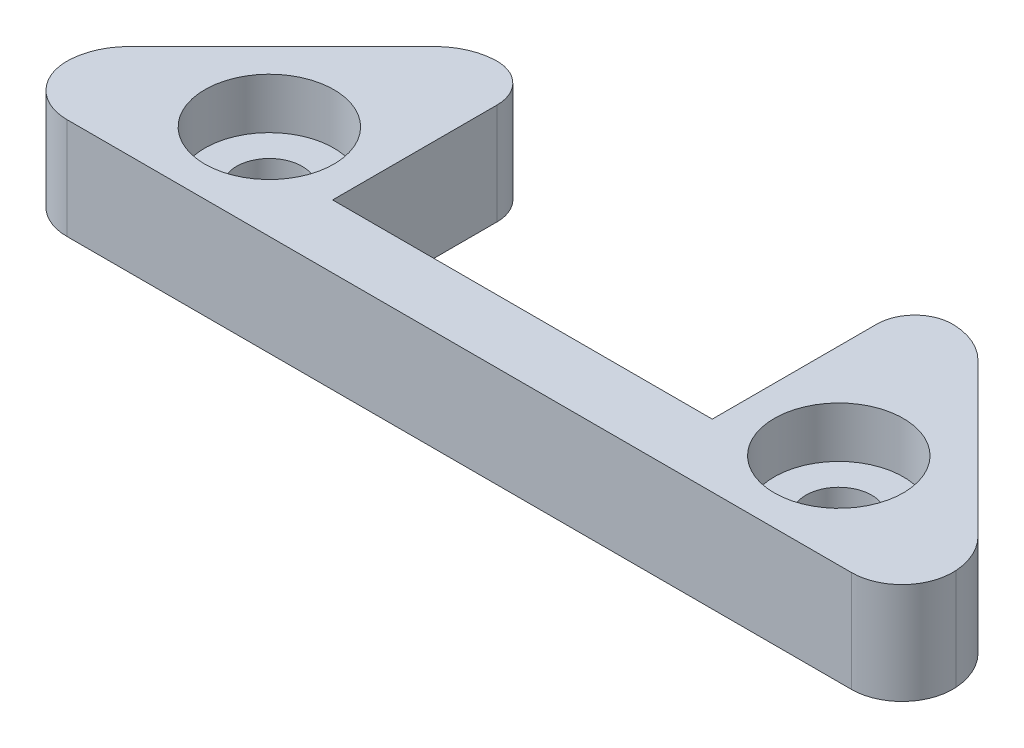
ISO-10303-21;
HEADER;
FILE_DESCRIPTION(('STEP AP214'),'2;1');
FILE_NAME('part.step','',(''),(''),'','','');
FILE_SCHEMA(('AUTOMOTIVE_DESIGN { 1 0 10303 214 1 1 1 1 }'));
ENDSEC;
DATA;
#1=APPLICATION_CONTEXT('core data for automotive mechanical design processes');
#2=APPLICATION_PROTOCOL_DEFINITION('international standard','automotive_design',2000,#1);
#3=PRODUCT_CONTEXT('',#1,'mechanical');
#4=PRODUCT('Part','Part','',(#3));
#5=PRODUCT_RELATED_PRODUCT_CATEGORY('part','',(#4));
#6=PRODUCT_DEFINITION_FORMATION('','',#4);
#7=PRODUCT_DEFINITION_CONTEXT('part definition',#1,'design');
#8=PRODUCT_DEFINITION('design','',#6,#7);
#9=PRODUCT_DEFINITION_SHAPE('','',#8);
#10=(LENGTH_UNIT() NAMED_UNIT(*) SI_UNIT(.MILLI.,.METRE.));
#11=(NAMED_UNIT(*) PLANE_ANGLE_UNIT() SI_UNIT($,.RADIAN.));
#12=(NAMED_UNIT(*) SI_UNIT($,.STERADIAN.) SOLID_ANGLE_UNIT());
#13=UNCERTAINTY_MEASURE_WITH_UNIT(LENGTH_MEASURE(1.E-05),#10,'distance_accuracy_value','');
#14=(GEOMETRIC_REPRESENTATION_CONTEXT(3) GLOBAL_UNCERTAINTY_ASSIGNED_CONTEXT((#13)) GLOBAL_UNIT_ASSIGNED_CONTEXT((#10,
#11,#12)) REPRESENTATION_CONTEXT('',''));
#15=CARTESIAN_POINT('',(0.,0.,0.));
#16=DIRECTION('',(0.,0.,1.));
#17=DIRECTION('',(1.,0.,0.));
#18=AXIS2_PLACEMENT_3D('',#15,#16,#17);
#19=CARTESIAN_POINT('',(0.,0.,0.));
#20=DIRECTION('',(0.,1.,0.));
#21=DIRECTION('',(0.,0.,1.));
#22=AXIS2_PLACEMENT_3D('',#19,#20,#21);
#23=PLANE('',#22);
#24=CARTESIAN_POINT('',(-22.5,0.,-7.49999999999999));
#25=DIRECTION('',(0.,1.,0.));
#26=DIRECTION('',(0.,0.,1.));
#27=AXIS2_PLACEMENT_3D('',#24,#25,#26);
#28=CIRCLE('',#27,2.6);
#29=CARTESIAN_POINT('',(-22.5,0.,-4.89999999999999));
#30=VERTEX_POINT('',#29);
#31=EDGE_CURVE('E205',#30,#30,#28,.T.);
#32=ORIENTED_EDGE('',*,*,#31,.T.);
#33=EDGE_LOOP('',(#32));
#34=FACE_BOUND('',#33,.T.);
#35=CARTESIAN_POINT('',(-22.5,0.,-7.49999999999982));
#36=DIRECTION('',(0.,-1.,0.));
#37=DIRECTION('',(0.,0.,-1.));
#38=AXIS2_PLACEMENT_3D('',#35,#36,#37);
#39=CIRCLE('',#38,4.5);
#40=CARTESIAN_POINT('',(-22.5,0.,-11.9999999999998));
#41=VERTEX_POINT('',#40);
#42=EDGE_CURVE('E344',#41,#41,#39,.T.);
#43=ORIENTED_EDGE('',*,*,#42,.T.);
#44=EDGE_LOOP('',(#43));
#45=FACE_BOUND('',#44,.T.);
#46=ADVANCED_FACE('F41',(#34,#45),#23,.F.);
#47=CARTESIAN_POINT('',(22.5,0.,-7.49999999999999));
#48=DIRECTION('',(0.,1.,0.));
#49=DIRECTION('',(0.,0.,1.));
#50=AXIS2_PLACEMENT_3D('',#47,#48,#49);
#51=CIRCLE('',#50,2.6);
#52=CARTESIAN_POINT('',(22.5,0.,-4.89999999999999));
#53=VERTEX_POINT('',#52);
#54=EDGE_CURVE('E184',#53,#53,#51,.T.);
#55=ORIENTED_EDGE('',*,*,#54,.T.);
#56=EDGE_LOOP('',(#55));
#57=FACE_BOUND('',#56,.T.);
#58=CARTESIAN_POINT('',(22.5,0.,-7.49999999999978));
#59=DIRECTION('',(0.,-1.,0.));
#60=DIRECTION('',(0.,0.,-1.));
#61=AXIS2_PLACEMENT_3D('',#58,#59,#60);
#62=CIRCLE('',#61,4.5);
#63=CARTESIAN_POINT('',(22.5,0.,-11.9999999999998));
#64=VERTEX_POINT('',#63);
#65=EDGE_CURVE('E336',#64,#64,#62,.T.);
#66=ORIENTED_EDGE('',*,*,#65,.T.);
#67=EDGE_LOOP('',(#66));
#68=FACE_BOUND('',#67,.T.);
#69=ADVANCED_FACE('F299',(#57,#68),#23,.F.);
#70=CARTESIAN_POINT('',(22.5,8.,-7.49999999999999));
#71=DIRECTION('',(0.,-1.,0.));
#72=DIRECTION('',(0.,0.,-1.));
#73=AXIS2_PLACEMENT_3D('',#70,#71,#72);
#74=CYLINDRICAL_SURFACE('',#73,2.6);
#75=ORIENTED_EDGE('',*,*,#54,.F.);
#76=EDGE_LOOP('',(#75));
#77=FACE_BOUND('',#76,.T.);
#78=CARTESIAN_POINT('',(22.5,4.,-7.49999999999999));
#79=DIRECTION('',(0.,1.,0.));
#80=DIRECTION('',(0.,0.,1.));
#81=AXIS2_PLACEMENT_3D('',#78,#79,#80);
#82=CIRCLE('',#81,2.6);
#83=CARTESIAN_POINT('',(22.5,4.,-4.89999999999999));
#84=VERTEX_POINT('',#83);
#85=EDGE_CURVE('E201',#84,#84,#82,.T.);
#86=ORIENTED_EDGE('',*,*,#85,.T.);
#87=EDGE_LOOP('',(#86));
#88=FACE_BOUND('',#87,.T.);
#89=ADVANCED_FACE('F306',(#77,#88),#74,.F.);
#90=CARTESIAN_POINT('',(-22.5,8.,-7.49999999999999));
#91=DIRECTION('',(0.,-1.,0.));
#92=DIRECTION('',(0.,0.,-1.));
#93=AXIS2_PLACEMENT_3D('',#90,#91,#92);
#94=CYLINDRICAL_SURFACE('',#93,2.6);
#95=ORIENTED_EDGE('',*,*,#31,.F.);
#96=EDGE_LOOP('',(#95));
#97=FACE_BOUND('',#96,.T.);
#98=CARTESIAN_POINT('',(-22.5,4.,-7.49999999999999));
#99=DIRECTION('',(0.,1.,0.));
#100=DIRECTION('',(0.,0.,1.));
#101=AXIS2_PLACEMENT_3D('',#98,#99,#100);
#102=CIRCLE('',#101,2.6);
#103=CARTESIAN_POINT('',(-22.5,4.,-4.89999999999999));
#104=VERTEX_POINT('',#103);
#105=EDGE_CURVE('E198',#104,#104,#102,.T.);
#106=ORIENTED_EDGE('',*,*,#105,.T.);
#107=EDGE_LOOP('',(#106));
#108=FACE_BOUND('',#107,.T.);
#109=ADVANCED_FACE('F322',(#97,#108),#94,.F.);
#110=CARTESIAN_POINT('',(0.,8.,0.));
#111=DIRECTION('',(0.,1.,0.));
#112=DIRECTION('',(0.,0.,1.));
#113=AXIS2_PLACEMENT_3D('',#110,#111,#112);
#114=PLANE('',#113);
#115=CARTESIAN_POINT('',(-22.5,8.,-7.49999999999999));
#116=DIRECTION('',(0.,1.,0.));
#117=DIRECTION('',(0.,0.,1.));
#118=AXIS2_PLACEMENT_3D('',#115,#116,#117);
#119=CIRCLE('',#118,5.1);
#120=CARTESIAN_POINT('',(-22.5,8.,-2.39999999999999));
#121=VERTEX_POINT('',#120);
#122=EDGE_CURVE('E348',#121,#121,#119,.T.);
#123=ORIENTED_EDGE('',*,*,#122,.F.);
#124=EDGE_LOOP('',(#123));
#125=FACE_BOUND('',#124,.T.);
#126=CARTESIAN_POINT('',(22.5,8.,-7.49999999999999));
#127=DIRECTION('',(0.,1.,0.));
#128=DIRECTION('',(0.,0.,1.));
#129=AXIS2_PLACEMENT_3D('',#126,#127,#128);
#130=CIRCLE('',#129,5.1);
#131=CARTESIAN_POINT('',(22.5,8.,-2.39999999999999));
#132=VERTEX_POINT('',#131);
#133=EDGE_CURVE('E351',#132,#132,#130,.T.);
#134=ORIENTED_EDGE('',*,*,#133,.F.);
#135=EDGE_LOOP('',(#134));
#136=FACE_BOUND('',#135,.T.);
#137=CARTESIAN_POINT('',(-30.,8.,-3.92893218813453));
#138=DIRECTION('',(0.,1.,0.));
#139=DIRECTION('',(0.,0.,1.));
#140=AXIS2_PLACEMENT_3D('',#137,#138,#139);
#141=CIRCLE('',#140,5.);
#142=CARTESIAN_POINT('',(-33.5355339059327,8.,-7.46446609406726));
#143=VERTEX_POINT('',#142);
#144=CARTESIAN_POINT('',(-34.9873574318387,8.,-4.2842712474619));
#145=VERTEX_POINT('',#144);
#146=EDGE_CURVE('E226',#143,#145,#141,.T.);
#147=ORIENTED_EDGE('',*,*,#146,.T.);
#148=CARTESIAN_POINT('',(-30.9974714863677,8.,-4.));
#149=DIRECTION('',(0.,1.,0.));
#150=DIRECTION('',(0.,0.,1.));
#151=AXIS2_PLACEMENT_3D('',#148,#149,#150);
#152=CIRCLE('',#151,4.);
#153=CARTESIAN_POINT('',(-30.9974714863677,8.,0.));
#154=VERTEX_POINT('',#153);
#155=EDGE_CURVE('E49',#145,#154,#152,.T.);
#156=ORIENTED_EDGE('',*,*,#155,.T.);
#157=DIRECTION('',(1.,0.,0.));
#158=VECTOR('',#157,1.);
#159=CARTESIAN_POINT('',(-35.,8.,0.));
#160=LINE('',#159,#158);
#161=CARTESIAN_POINT('',(30.9974714863677,8.,0.));
#162=VERTEX_POINT('',#161);
#163=EDGE_CURVE('E179',#154,#162,#160,.T.);
#164=ORIENTED_EDGE('',*,*,#163,.T.);
#165=CARTESIAN_POINT('',(30.9974714863677,8.,-4.));
#166=DIRECTION('',(0.,1.,0.));
#167=DIRECTION('',(0.,0.,1.));
#168=AXIS2_PLACEMENT_3D('',#165,#166,#167);
#169=CIRCLE('',#168,4.);
#170=CARTESIAN_POINT('',(34.9873574318387,8.,-4.28427124746189));
#171=VERTEX_POINT('',#170);
#172=EDGE_CURVE('E56',#162,#171,#169,.T.);
#173=ORIENTED_EDGE('',*,*,#172,.T.);
#174=CARTESIAN_POINT('',(30.,8.,-3.92893218813453));
#175=DIRECTION('',(0.,1.,0.));
#176=DIRECTION('',(0.,0.,1.));
#177=AXIS2_PLACEMENT_3D('',#174,#175,#176);
#178=CIRCLE('',#177,5.);
#179=CARTESIAN_POINT('',(33.5355339059327,8.,-7.46446609406727));
#180=VERTEX_POINT('',#179);
#181=EDGE_CURVE('E222',#171,#180,#178,.T.);
#182=ORIENTED_EDGE('',*,*,#181,.T.);
#183=DIRECTION('',(-0.707106781186547,0.,-0.707106781186548));
#184=VECTOR('',#183,1.);
#185=CARTESIAN_POINT('',(20.,8.,-21.));
#186=LINE('',#185,#184);
#187=CARTESIAN_POINT('',(21.4644660940673,8.,-19.5355339059327));
#188=VERTEX_POINT('',#187);
#189=EDGE_CURVE('E156',#180,#188,#186,.T.);
#190=ORIENTED_EDGE('',*,*,#189,.T.);
#191=CARTESIAN_POINT('',(17.9289321881345,8.,-16.));
#192=DIRECTION('',(0.,1.,0.));
#193=DIRECTION('',(0.,0.,1.));
#194=AXIS2_PLACEMENT_3D('',#191,#192,#193);
#195=CIRCLE('',#194,5.);
#196=CARTESIAN_POINT('',(18.1066017177982,8.,-20.9968423567518));
#197=VERTEX_POINT('',#196);
#198=EDGE_CURVE('E220',#188,#197,#195,.T.);
#199=ORIENTED_EDGE('',*,*,#198,.T.);
#200=CARTESIAN_POINT('',(18.,8.,-17.9987369427007));
#201=DIRECTION('',(0.,1.,0.));
#202=DIRECTION('',(0.,0.,1.));
#203=AXIS2_PLACEMENT_3D('',#200,#201,#202);
#204=CIRCLE('',#203,3.);
#205=CARTESIAN_POINT('',(15.,8.,-17.9987369427007));
#206=VERTEX_POINT('',#205);
#207=EDGE_CURVE('E152',#197,#206,#204,.T.);
#208=ORIENTED_EDGE('',*,*,#207,.T.);
#209=DIRECTION('',(0.,0.,1.));
#210=VECTOR('',#209,1.);
#211=CARTESIAN_POINT('',(15.,8.,-5.));
#212=LINE('',#211,#210);
#213=CARTESIAN_POINT('',(15.,8.,-5.));
#214=VERTEX_POINT('',#213);
#215=EDGE_CURVE('E143',#206,#214,#212,.T.);
#216=ORIENTED_EDGE('',*,*,#215,.T.);
#217=DIRECTION('',(-1.,0.,0.));
#218=VECTOR('',#217,1.);
#219=CARTESIAN_POINT('',(-15.,8.,-5.));
#220=LINE('',#219,#218);
#221=CARTESIAN_POINT('',(-15.,8.,-5.));
#222=VERTEX_POINT('',#221);
#223=EDGE_CURVE('E148',#214,#222,#220,.T.);
#224=ORIENTED_EDGE('',*,*,#223,.T.);
#225=DIRECTION('',(0.,0.,-1.));
#226=VECTOR('',#225,1.);
#227=CARTESIAN_POINT('',(-15.,8.,-21.));
#228=LINE('',#227,#226);
#229=CARTESIAN_POINT('',(-15.,8.,-17.9987369427007));
#230=VERTEX_POINT('',#229);
#231=EDGE_CURVE('E171',#222,#230,#228,.T.);
#232=ORIENTED_EDGE('',*,*,#231,.T.);
#233=CARTESIAN_POINT('',(-18.,8.,-17.9987369427007));
#234=DIRECTION('',(0.,1.,0.));
#235=DIRECTION('',(0.,0.,1.));
#236=AXIS2_PLACEMENT_3D('',#233,#234,#235);
#237=CIRCLE('',#236,3.);
#238=CARTESIAN_POINT('',(-18.1066017177982,8.,-20.9968423567518));
#239=VERTEX_POINT('',#238);
#240=EDGE_CURVE('E243',#230,#239,#237,.T.);
#241=ORIENTED_EDGE('',*,*,#240,.T.);
#242=CARTESIAN_POINT('',(-17.9289321881345,8.,-16.));
#243=DIRECTION('',(0.,1.,0.));
#244=DIRECTION('',(0.,0.,1.));
#245=AXIS2_PLACEMENT_3D('',#242,#243,#244);
#246=CIRCLE('',#245,5.);
#247=CARTESIAN_POINT('',(-21.4644660940673,8.,-19.5355339059327));
#248=VERTEX_POINT('',#247);
#249=EDGE_CURVE('E224',#239,#248,#246,.T.);
#250=ORIENTED_EDGE('',*,*,#249,.T.);
#251=DIRECTION('',(-0.707106781186547,0.,0.707106781186548));
#252=VECTOR('',#251,1.);
#253=CARTESIAN_POINT('',(-35.,8.,-6.));
#254=LINE('',#253,#252);
#255=EDGE_CURVE('E173',#248,#143,#254,.T.);
#256=ORIENTED_EDGE('',*,*,#255,.T.);
#257=EDGE_LOOP('',(#147,#156,#164,#173,#182,#190,#199,#208,#216,#224,#232,#241,#250,#256));
#258=FACE_BOUND('',#257,.T.);
#259=ADVANCED_FACE('F145',(#125,#136,#258),#114,.T.);
#260=CARTESIAN_POINT('',(-22.5,0.,-7.49999999999982));
#261=DIRECTION('',(0.,-1.,0.));
#262=DIRECTION('',(0.,0.,-1.));
#263=AXIS2_PLACEMENT_3D('',#260,#261,#262);
#264=CIRCLE('',#263,5.5);
#265=CARTESIAN_POINT('',(-22.5,0.,-12.9999999999998));
#266=VERTEX_POINT('',#265);
#267=EDGE_CURVE('E327',#266,#266,#264,.T.);
#268=ORIENTED_EDGE('',*,*,#267,.F.);
#269=EDGE_LOOP('',(#268));
#270=FACE_BOUND('',#269,.T.);
#271=CARTESIAN_POINT('',(22.5,0.,-7.49999999999978));
#272=DIRECTION('',(0.,-1.,0.));
#273=DIRECTION('',(0.,0.,-1.));
#274=AXIS2_PLACEMENT_3D('',#271,#272,#273);
#275=CIRCLE('',#274,5.5);
#276=CARTESIAN_POINT('',(22.5,0.,-12.9999999999998));
#277=VERTEX_POINT('',#276);
#278=EDGE_CURVE('E330',#277,#277,#275,.T.);
#279=ORIENTED_EDGE('',*,*,#278,.F.);
#280=EDGE_LOOP('',(#279));
#281=FACE_BOUND('',#280,.T.);
#282=DIRECTION('',(1.,0.,0.));
#283=VECTOR('',#282,1.);
#284=CARTESIAN_POINT('',(-35.,0.,0.));
#285=LINE('',#284,#283);
#286=CARTESIAN_POINT('',(-30.9974714863677,0.,0.));
#287=VERTEX_POINT('',#286);
#288=CARTESIAN_POINT('',(30.9974714863677,0.,0.));
#289=VERTEX_POINT('',#288);
#290=EDGE_CURVE('E194',#287,#289,#285,.T.);
#291=ORIENTED_EDGE('',*,*,#290,.F.);
#292=CARTESIAN_POINT('',(-30.9974714863677,0.,-4.));
#293=DIRECTION('',(0.,1.,0.));
#294=DIRECTION('',(0.,0.,1.));
#295=AXIS2_PLACEMENT_3D('',#292,#293,#294);
#296=CIRCLE('',#295,4.);
#297=CARTESIAN_POINT('',(-34.9873574318387,0.,-4.2842712474619));
#298=VERTEX_POINT('',#297);
#299=EDGE_CURVE('E256',#287,#298,#296,.F.);
#300=ORIENTED_EDGE('',*,*,#299,.T.);
#301=CARTESIAN_POINT('',(-30.,0.,-3.92893218813453));
#302=DIRECTION('',(0.,1.,0.));
#303=DIRECTION('',(0.,0.,1.));
#304=AXIS2_PLACEMENT_3D('',#301,#302,#303);
#305=CIRCLE('',#304,5.);
#306=CARTESIAN_POINT('',(-33.5355339059327,0.,-7.46446609406726));
#307=VERTEX_POINT('',#306);
#308=EDGE_CURVE('E213',#298,#307,#305,.F.);
#309=ORIENTED_EDGE('',*,*,#308,.T.);
#310=DIRECTION('',(-0.707106781186547,0.,0.707106781186548));
#311=VECTOR('',#310,1.);
#312=CARTESIAN_POINT('',(-35.,0.,-6.));
#313=LINE('',#312,#311);
#314=CARTESIAN_POINT('',(-21.4644660940673,0.,-19.5355339059327));
#315=VERTEX_POINT('',#314);
#316=EDGE_CURVE('E191',#315,#307,#313,.T.);
#317=ORIENTED_EDGE('',*,*,#316,.F.);
#318=CARTESIAN_POINT('',(-17.9289321881345,0.,-16.));
#319=DIRECTION('',(0.,1.,0.));
#320=DIRECTION('',(0.,0.,1.));
#321=AXIS2_PLACEMENT_3D('',#318,#319,#320);
#322=CIRCLE('',#321,5.);
#323=CARTESIAN_POINT('',(-18.1066017177982,0.,-20.9968423567518));
#324=VERTEX_POINT('',#323);
#325=EDGE_CURVE('E210',#315,#324,#322,.F.);
#326=ORIENTED_EDGE('',*,*,#325,.T.);
#327=CARTESIAN_POINT('',(-18.,0.,-17.9987369427007));
#328=DIRECTION('',(0.,1.,0.));
#329=DIRECTION('',(0.,0.,1.));
#330=AXIS2_PLACEMENT_3D('',#327,#328,#329);
#331=CIRCLE('',#330,3.);
#332=CARTESIAN_POINT('',(-15.,0.,-17.9987369427007));
#333=VERTEX_POINT('',#332);
#334=EDGE_CURVE('E238',#324,#333,#331,.F.);
#335=ORIENTED_EDGE('',*,*,#334,.T.);
#336=DIRECTION('',(0.,0.,-1.));
#337=VECTOR('',#336,1.);
#338=CARTESIAN_POINT('',(-15.,0.,-21.));
#339=LINE('',#338,#337);
#340=CARTESIAN_POINT('',(-15.,0.,-5.));
#341=VERTEX_POINT('',#340);
#342=EDGE_CURVE('E188',#341,#333,#339,.T.);
#343=ORIENTED_EDGE('',*,*,#342,.F.);
#344=DIRECTION('',(-1.,0.,0.));
#345=VECTOR('',#344,1.);
#346=CARTESIAN_POINT('',(-15.,0.,-5.));
#347=LINE('',#346,#345);
#348=CARTESIAN_POINT('',(15.,0.,-5.));
#349=VERTEX_POINT('',#348);
#350=EDGE_CURVE('E186',#349,#341,#347,.T.);
#351=ORIENTED_EDGE('',*,*,#350,.F.);
#352=DIRECTION('',(0.,0.,1.));
#353=VECTOR('',#352,1.);
#354=CARTESIAN_POINT('',(15.,0.,-5.));
#355=LINE('',#354,#353);
#356=CARTESIAN_POINT('',(15.,0.,-17.9987369427007));
#357=VERTEX_POINT('',#356);
#358=EDGE_CURVE('E162',#357,#349,#355,.T.);
#359=ORIENTED_EDGE('',*,*,#358,.F.);
#360=CARTESIAN_POINT('',(18.,0.,-17.9987369427007));
#361=DIRECTION('',(0.,1.,0.));
#362=DIRECTION('',(0.,0.,1.));
#363=AXIS2_PLACEMENT_3D('',#360,#361,#362);
#364=CIRCLE('',#363,3.);
#365=CARTESIAN_POINT('',(18.1066017177982,0.,-20.9968423567518));
#366=VERTEX_POINT('',#365);
#367=EDGE_CURVE('E236',#357,#366,#364,.F.);
#368=ORIENTED_EDGE('',*,*,#367,.T.);
#369=CARTESIAN_POINT('',(17.9289321881345,0.,-16.));
#370=DIRECTION('',(0.,1.,0.));
#371=DIRECTION('',(0.,0.,1.));
#372=AXIS2_PLACEMENT_3D('',#369,#370,#371);
#373=CIRCLE('',#372,5.);
#374=CARTESIAN_POINT('',(21.4644660940673,0.,-19.5355339059327));
#375=VERTEX_POINT('',#374);
#376=EDGE_CURVE('E165',#366,#375,#373,.F.);
#377=ORIENTED_EDGE('',*,*,#376,.T.);
#378=DIRECTION('',(-0.707106781186547,0.,-0.707106781186548));
#379=VECTOR('',#378,1.);
#380=CARTESIAN_POINT('',(20.,0.,-21.));
#381=LINE('',#380,#379);
#382=CARTESIAN_POINT('',(33.5355339059327,0.,-7.46446609406727));
#383=VERTEX_POINT('',#382);
#384=EDGE_CURVE('E181',#383,#375,#381,.T.);
#385=ORIENTED_EDGE('',*,*,#384,.F.);
#386=CARTESIAN_POINT('',(30.,0.,-3.92893218813453));
#387=DIRECTION('',(0.,1.,0.));
#388=DIRECTION('',(0.,0.,1.));
#389=AXIS2_PLACEMENT_3D('',#386,#387,#388);
#390=CIRCLE('',#389,5.);
#391=CARTESIAN_POINT('',(34.9873574318387,0.,-4.28427124746189));
#392=VERTEX_POINT('',#391);
#393=EDGE_CURVE('E207',#383,#392,#390,.F.);
#394=ORIENTED_EDGE('',*,*,#393,.T.);
#395=CARTESIAN_POINT('',(30.9974714863677,0.,-4.));
#396=DIRECTION('',(0.,1.,0.));
#397=DIRECTION('',(0.,0.,1.));
#398=AXIS2_PLACEMENT_3D('',#395,#396,#397);
#399=CIRCLE('',#398,4.);
#400=EDGE_CURVE('E254',#392,#289,#399,.F.);
#401=ORIENTED_EDGE('',*,*,#400,.T.);
#402=EDGE_LOOP('',(#291,#300,#309,#317,#326,#335,#343,#351,#359,#368,#377,#385,#394,#401));
#403=FACE_BOUND('',#402,.T.);
#404=ADVANCED_FACE('F269',(#270,#281,#403),#23,.F.);
#405=CARTESIAN_POINT('',(20.,8.,-21.));
#406=DIRECTION('',(-0.707106781186548,0.,0.707106781186547));
#407=DIRECTION('',(0.707106781186547,0.,0.707106781186548));
#408=AXIS2_PLACEMENT_3D('',#405,#406,#407);
#409=PLANE('',#408);
#410=ORIENTED_EDGE('',*,*,#189,.F.);
#411=DIRECTION('',(0.,-1.,0.));
#412=VECTOR('',#411,1.);
#413=CARTESIAN_POINT('',(33.5355339059327,8.,-7.46446609406727));
#414=LINE('',#413,#412);
#415=EDGE_CURVE('E230',#180,#383,#414,.T.);
#416=ORIENTED_EDGE('',*,*,#415,.T.);
#417=ORIENTED_EDGE('',*,*,#384,.T.);
#418=DIRECTION('',(0.,-1.,0.));
#419=VECTOR('',#418,1.);
#420=CARTESIAN_POINT('',(21.4644660940673,8.,-19.5355339059327));
#421=LINE('',#420,#419);
#422=EDGE_CURVE('E228',#375,#188,#421,.F.);
#423=ORIENTED_EDGE('',*,*,#422,.T.);
#424=EDGE_LOOP('',(#410,#416,#417,#423));
#425=FACE_BOUND('',#424,.T.);
#426=ADVANCED_FACE('F313',(#425),#409,.F.);
#427=CARTESIAN_POINT('',(15.,8.,-5.));
#428=DIRECTION('',(1.,0.,0.));
#429=DIRECTION('',(0.,0.,-1.));
#430=AXIS2_PLACEMENT_3D('',#427,#428,#429);
#431=PLANE('',#430);
#432=ORIENTED_EDGE('',*,*,#215,.F.);
#433=DIRECTION('',(0.,1.,0.));
#434=VECTOR('',#433,1.);
#435=CARTESIAN_POINT('',(15.,0.,-17.9987369427007));
#436=LINE('',#435,#434);
#437=EDGE_CURVE('E245',#206,#357,#436,.F.);
#438=ORIENTED_EDGE('',*,*,#437,.T.);
#439=ORIENTED_EDGE('',*,*,#358,.T.);
#440=DIRECTION('',(0.,-1.,0.));
#441=VECTOR('',#440,1.);
#442=CARTESIAN_POINT('',(15.,8.,-5.));
#443=LINE('',#442,#441);
#444=EDGE_CURVE('E159',#214,#349,#443,.T.);
#445=ORIENTED_EDGE('',*,*,#444,.F.);
#446=EDGE_LOOP('',(#432,#438,#439,#445));
#447=FACE_BOUND('',#446,.T.);
#448=ADVANCED_FACE('F160',(#447),#431,.F.);
#449=CARTESIAN_POINT('',(-15.,8.,-5.));
#450=DIRECTION('',(0.,0.,1.));
#451=DIRECTION('',(1.,0.,0.));
#452=AXIS2_PLACEMENT_3D('',#449,#450,#451);
#453=PLANE('',#452);
#454=ORIENTED_EDGE('',*,*,#350,.T.);
#455=DIRECTION('',(0.,-1.,0.));
#456=VECTOR('',#455,1.);
#457=CARTESIAN_POINT('',(-15.,8.,-5.));
#458=LINE('',#457,#456);
#459=EDGE_CURVE('E166',#222,#341,#458,.T.);
#460=ORIENTED_EDGE('',*,*,#459,.F.);
#461=ORIENTED_EDGE('',*,*,#223,.F.);
#462=ORIENTED_EDGE('',*,*,#444,.T.);
#463=EDGE_LOOP('',(#454,#460,#461,#462));
#464=FACE_BOUND('',#463,.T.);
#465=ADVANCED_FACE('F168',(#464),#453,.F.);
#466=CARTESIAN_POINT('',(-15.,8.,-21.));
#467=DIRECTION('',(-1.,0.,0.));
#468=DIRECTION('',(0.,0.,1.));
#469=AXIS2_PLACEMENT_3D('',#466,#467,#468);
#470=PLANE('',#469);
#471=ORIENTED_EDGE('',*,*,#342,.T.);
#472=DIRECTION('',(0.,1.,0.));
#473=VECTOR('',#472,1.);
#474=CARTESIAN_POINT('',(-15.,8.,-17.9987369427007));
#475=LINE('',#474,#473);
#476=EDGE_CURVE('E240',#333,#230,#475,.T.);
#477=ORIENTED_EDGE('',*,*,#476,.T.);
#478=ORIENTED_EDGE('',*,*,#231,.F.);
#479=ORIENTED_EDGE('',*,*,#459,.T.);
#480=EDGE_LOOP('',(#471,#477,#478,#479));
#481=FACE_BOUND('',#480,.T.);
#482=ADVANCED_FACE('F287',(#481),#470,.F.);
#483=CARTESIAN_POINT('',(-35.,8.,-6.));
#484=DIRECTION('',(0.707106781186548,0.,0.707106781186547));
#485=DIRECTION('',(0.707106781186547,0.,-0.707106781186548));
#486=AXIS2_PLACEMENT_3D('',#483,#484,#485);
#487=PLANE('',#486);
#488=ORIENTED_EDGE('',*,*,#316,.T.);
#489=DIRECTION('',(0.,-1.,0.));
#490=VECTOR('',#489,1.);
#491=CARTESIAN_POINT('',(-33.5355339059327,8.,-7.46446609406726));
#492=LINE('',#491,#490);
#493=EDGE_CURVE('E218',#307,#143,#492,.F.);
#494=ORIENTED_EDGE('',*,*,#493,.T.);
#495=ORIENTED_EDGE('',*,*,#255,.F.);
#496=DIRECTION('',(0.,-1.,0.));
#497=VECTOR('',#496,1.);
#498=CARTESIAN_POINT('',(-21.4644660940673,8.,-19.5355339059327));
#499=LINE('',#498,#497);
#500=EDGE_CURVE('E215',#248,#315,#499,.T.);
#501=ORIENTED_EDGE('',*,*,#500,.T.);
#502=EDGE_LOOP('',(#488,#494,#495,#501));
#503=FACE_BOUND('',#502,.T.);
#504=ADVANCED_FACE('F275',(#503),#487,.F.);
#505=CARTESIAN_POINT('',(-35.,8.,0.));
#506=DIRECTION('',(0.,0.,-1.));
#507=DIRECTION('',(-1.,0.,0.));
#508=AXIS2_PLACEMENT_3D('',#505,#506,#507);
#509=PLANE('',#508);
#510=ORIENTED_EDGE('',*,*,#163,.F.);
#511=DIRECTION('',(0.,1.,0.));
#512=VECTOR('',#511,1.);
#513=CARTESIAN_POINT('',(-30.9974714863677,0.,0.));
#514=LINE('',#513,#512);
#515=EDGE_CURVE('E251',#154,#287,#514,.F.);
#516=ORIENTED_EDGE('',*,*,#515,.T.);
#517=ORIENTED_EDGE('',*,*,#290,.T.);
#518=DIRECTION('',(0.,1.,0.));
#519=VECTOR('',#518,1.);
#520=CARTESIAN_POINT('',(30.9974714863677,8.,0.));
#521=LINE('',#520,#519);
#522=EDGE_CURVE('E249',#289,#162,#521,.T.);
#523=ORIENTED_EDGE('',*,*,#522,.T.);
#524=EDGE_LOOP('',(#510,#516,#517,#523));
#525=FACE_BOUND('',#524,.T.);
#526=ADVANCED_FACE('F264',(#525),#509,.F.);
#527=CARTESIAN_POINT('',(-22.5,4.,-7.49999999999999));
#528=DIRECTION('',(0.,1.,0.));
#529=DIRECTION('',(0.,0.,1.));
#530=AXIS2_PLACEMENT_3D('',#527,#528,#529);
#531=CYLINDRICAL_SURFACE('',#530,5.1);
#532=CARTESIAN_POINT('',(-22.5,4.,-7.49999999999999));
#533=DIRECTION('',(0.,1.,0.));
#534=DIRECTION('',(0.,0.,1.));
#535=AXIS2_PLACEMENT_3D('',#532,#533,#534);
#536=CIRCLE('',#535,5.1);
#537=CARTESIAN_POINT('',(-22.5,4.,-2.39999999999999));
#538=VERTEX_POINT('',#537);
#539=EDGE_CURVE('E202',#538,#538,#536,.T.);
#540=ORIENTED_EDGE('',*,*,#539,.F.);
#541=EDGE_LOOP('',(#540));
#542=FACE_BOUND('',#541,.T.);
#543=ORIENTED_EDGE('',*,*,#122,.T.);
#544=EDGE_LOOP('',(#543));
#545=FACE_BOUND('',#544,.T.);
#546=ADVANCED_FACE('F550',(#542,#545),#531,.F.);
#547=CARTESIAN_POINT('',(-22.5,4.,-7.49999999999999));
#548=DIRECTION('',(0.,1.,0.));
#549=DIRECTION('',(0.,0.,1.));
#550=AXIS2_PLACEMENT_3D('',#547,#548,#549);
#551=PLANE('',#550);
#552=ORIENTED_EDGE('',*,*,#105,.F.);
#553=EDGE_LOOP('',(#552));
#554=FACE_BOUND('',#553,.T.);
#555=ORIENTED_EDGE('',*,*,#539,.T.);
#556=EDGE_LOOP('',(#555));
#557=FACE_BOUND('',#556,.T.);
#558=ADVANCED_FACE('F575',(#554,#557),#551,.T.);
#559=CARTESIAN_POINT('',(22.5,4.,-7.49999999999999));
#560=DIRECTION('',(0.,1.,0.));
#561=DIRECTION('',(0.,0.,1.));
#562=AXIS2_PLACEMENT_3D('',#559,#560,#561);
#563=CYLINDRICAL_SURFACE('',#562,5.1);
#564=CARTESIAN_POINT('',(22.5,4.,-7.49999999999999));
#565=DIRECTION('',(0.,1.,0.));
#566=DIRECTION('',(0.,0.,1.));
#567=AXIS2_PLACEMENT_3D('',#564,#565,#566);
#568=CIRCLE('',#567,5.1);
#569=CARTESIAN_POINT('',(22.5,4.,-2.39999999999999));
#570=VERTEX_POINT('',#569);
#571=EDGE_CURVE('E354',#570,#570,#568,.T.);
#572=ORIENTED_EDGE('',*,*,#571,.F.);
#573=EDGE_LOOP('',(#572));
#574=FACE_BOUND('',#573,.T.);
#575=ORIENTED_EDGE('',*,*,#133,.T.);
#576=EDGE_LOOP('',(#575));
#577=FACE_BOUND('',#576,.T.);
#578=ADVANCED_FACE('F583',(#574,#577),#563,.F.);
#579=CARTESIAN_POINT('',(22.5,4.,-7.49999999999999));
#580=DIRECTION('',(0.,1.,0.));
#581=DIRECTION('',(0.,0.,1.));
#582=AXIS2_PLACEMENT_3D('',#579,#580,#581);
#583=PLANE('',#582);
#584=ORIENTED_EDGE('',*,*,#85,.F.);
#585=EDGE_LOOP('',(#584));
#586=FACE_BOUND('',#585,.T.);
#587=ORIENTED_EDGE('',*,*,#571,.T.);
#588=EDGE_LOOP('',(#587));
#589=FACE_BOUND('',#588,.T.);
#590=ADVANCED_FACE('F461',(#586,#589),#583,.T.);
#591=CARTESIAN_POINT('',(22.5,2.,-7.49999999999978));
#592=DIRECTION('',(0.,-1.,0.));
#593=DIRECTION('',(0.,0.,-1.));
#594=AXIS2_PLACEMENT_3D('',#591,#592,#593);
#595=CYLINDRICAL_SURFACE('',#594,5.5);
#596=CARTESIAN_POINT('',(22.5,2.,-7.49999999999978));
#597=DIRECTION('',(0.,-1.,0.));
#598=DIRECTION('',(0.,0.,-1.));
#599=AXIS2_PLACEMENT_3D('',#596,#597,#598);
#600=CIRCLE('',#599,5.5);
#601=CARTESIAN_POINT('',(22.5,2.,-12.9999999999998));
#602=VERTEX_POINT('',#601);
#603=EDGE_CURVE('E333',#602,#602,#600,.T.);
#604=ORIENTED_EDGE('',*,*,#603,.F.);
#605=EDGE_LOOP('',(#604));
#606=FACE_BOUND('',#605,.T.);
#607=ORIENTED_EDGE('',*,*,#278,.T.);
#608=EDGE_LOOP('',(#607));
#609=FACE_BOUND('',#608,.T.);
#610=ADVANCED_FACE('F453',(#606,#609),#595,.F.);
#611=CARTESIAN_POINT('',(22.5,2.,-7.49999999999978));
#612=DIRECTION('',(0.,-1.,0.));
#613=DIRECTION('',(0.,0.,-1.));
#614=AXIS2_PLACEMENT_3D('',#611,#612,#613);
#615=PLANE('',#614);
#616=CARTESIAN_POINT('',(22.5,2.,-7.49999999999978));
#617=DIRECTION('',(0.,-1.,0.));
#618=DIRECTION('',(0.,0.,-1.));
#619=AXIS2_PLACEMENT_3D('',#616,#617,#618);
#620=CIRCLE('',#619,4.5);
#621=CARTESIAN_POINT('',(22.5,2.,-11.9999999999998));
#622=VERTEX_POINT('',#621);
#623=EDGE_CURVE('E332',#622,#622,#620,.T.);
#624=ORIENTED_EDGE('',*,*,#623,.F.);
#625=EDGE_LOOP('',(#624));
#626=FACE_BOUND('',#625,.T.);
#627=ORIENTED_EDGE('',*,*,#603,.T.);
#628=EDGE_LOOP('',(#627));
#629=FACE_BOUND('',#628,.T.);
#630=ADVANCED_FACE('F444',(#626,#629),#615,.T.);
#631=CARTESIAN_POINT('',(22.5,2.,-7.49999999999978));
#632=DIRECTION('',(0.,-1.,0.));
#633=DIRECTION('',(0.,0.,-1.));
#634=AXIS2_PLACEMENT_3D('',#631,#632,#633);
#635=CYLINDRICAL_SURFACE('',#634,4.5);
#636=ORIENTED_EDGE('',*,*,#623,.T.);
#637=EDGE_LOOP('',(#636));
#638=FACE_BOUND('',#637,.T.);
#639=ORIENTED_EDGE('',*,*,#65,.F.);
#640=EDGE_LOOP('',(#639));
#641=FACE_BOUND('',#640,.T.);
#642=ADVANCED_FACE('F435',(#638,#641),#635,.T.);
#643=CARTESIAN_POINT('',(-22.5,2.,-7.49999999999982));
#644=DIRECTION('',(0.,-1.,0.));
#645=DIRECTION('',(0.,0.,-1.));
#646=AXIS2_PLACEMENT_3D('',#643,#644,#645);
#647=CYLINDRICAL_SURFACE('',#646,5.5);
#648=CARTESIAN_POINT('',(-22.5,2.,-7.49999999999982));
#649=DIRECTION('',(0.,-1.,0.));
#650=DIRECTION('',(0.,0.,-1.));
#651=AXIS2_PLACEMENT_3D('',#648,#649,#650);
#652=CIRCLE('',#651,5.5);
#653=CARTESIAN_POINT('',(-22.5,2.,-12.9999999999998));
#654=VERTEX_POINT('',#653);
#655=EDGE_CURVE('E357',#654,#654,#652,.T.);
#656=ORIENTED_EDGE('',*,*,#655,.F.);
#657=EDGE_LOOP('',(#656));
#658=FACE_BOUND('',#657,.T.);
#659=ORIENTED_EDGE('',*,*,#267,.T.);
#660=EDGE_LOOP('',(#659));
#661=FACE_BOUND('',#660,.T.);
#662=ADVANCED_FACE('F426',(#658,#661),#647,.F.);
#663=CARTESIAN_POINT('',(-22.5,2.,-7.49999999999982));
#664=DIRECTION('',(0.,-1.,0.));
#665=DIRECTION('',(0.,0.,-1.));
#666=AXIS2_PLACEMENT_3D('',#663,#664,#665);
#667=PLANE('',#666);
#668=CARTESIAN_POINT('',(-22.5,2.,-7.49999999999982));
#669=DIRECTION('',(0.,-1.,0.));
#670=DIRECTION('',(0.,0.,-1.));
#671=AXIS2_PLACEMENT_3D('',#668,#669,#670);
#672=CIRCLE('',#671,4.5);
#673=CARTESIAN_POINT('',(-22.5,2.,-11.9999999999998));
#674=VERTEX_POINT('',#673);
#675=EDGE_CURVE('E633',#674,#674,#672,.T.);
#676=ORIENTED_EDGE('',*,*,#675,.F.);
#677=EDGE_LOOP('',(#676));
#678=FACE_BOUND('',#677,.T.);
#679=ORIENTED_EDGE('',*,*,#655,.T.);
#680=EDGE_LOOP('',(#679));
#681=FACE_BOUND('',#680,.T.);
#682=ADVANCED_FACE('F416',(#678,#681),#667,.T.);
#683=CARTESIAN_POINT('',(-22.5,2.,-7.49999999999982));
#684=DIRECTION('',(0.,-1.,0.));
#685=DIRECTION('',(0.,0.,-1.));
#686=AXIS2_PLACEMENT_3D('',#683,#684,#685);
#687=CYLINDRICAL_SURFACE('',#686,4.5);
#688=ORIENTED_EDGE('',*,*,#675,.T.);
#689=EDGE_LOOP('',(#688));
#690=FACE_BOUND('',#689,.T.);
#691=ORIENTED_EDGE('',*,*,#42,.F.);
#692=EDGE_LOOP('',(#691));
#693=FACE_BOUND('',#692,.T.);
#694=ADVANCED_FACE('F393',(#690,#693),#687,.T.);
#695=CARTESIAN_POINT('',(-30.,8.,-3.92893218813453));
#696=DIRECTION('',(0.,-1.,0.));
#697=DIRECTION('',(0.,0.,-1.));
#698=AXIS2_PLACEMENT_3D('',#695,#696,#697);
#699=CYLINDRICAL_SURFACE('',#698,5.);
#700=ORIENTED_EDGE('',*,*,#308,.F.);
#701=DIRECTION('',(0.,-1.,0.));
#702=VECTOR('',#701,1.);
#703=CARTESIAN_POINT('',(-34.9873574318387,8.,-4.2842712474619));
#704=LINE('',#703,#702);
#705=EDGE_CURVE('E64',#298,#145,#704,.F.);
#706=ORIENTED_EDGE('',*,*,#705,.T.);
#707=ORIENTED_EDGE('',*,*,#146,.F.);
#708=ORIENTED_EDGE('',*,*,#493,.F.);
#709=EDGE_LOOP('',(#700,#706,#707,#708));
#710=FACE_BOUND('',#709,.T.);
#711=ADVANCED_FACE('F272',(#710),#699,.T.);
#712=CARTESIAN_POINT('',(-17.9289321881345,8.,-16.));
#713=DIRECTION('',(0.,-1.,0.));
#714=DIRECTION('',(0.,0.,-1.));
#715=AXIS2_PLACEMENT_3D('',#712,#713,#714);
#716=CYLINDRICAL_SURFACE('',#715,5.);
#717=ORIENTED_EDGE('',*,*,#249,.F.);
#718=DIRECTION('',(0.,-1.,0.));
#719=VECTOR('',#718,1.);
#720=CARTESIAN_POINT('',(-18.1066017177982,8.,-20.9968423567518));
#721=LINE('',#720,#719);
#722=EDGE_CURVE('E233',#239,#324,#721,.T.);
#723=ORIENTED_EDGE('',*,*,#722,.T.);
#724=ORIENTED_EDGE('',*,*,#325,.F.);
#725=ORIENTED_EDGE('',*,*,#500,.F.);
#726=EDGE_LOOP('',(#717,#723,#724,#725));
#727=FACE_BOUND('',#726,.T.);
#728=ADVANCED_FACE('F281',(#727),#716,.T.);
#729=CARTESIAN_POINT('',(30.,8.,-3.92893218813453));
#730=DIRECTION('',(0.,-1.,0.));
#731=DIRECTION('',(0.,0.,-1.));
#732=AXIS2_PLACEMENT_3D('',#729,#730,#731);
#733=CYLINDRICAL_SURFACE('',#732,5.);
#734=ORIENTED_EDGE('',*,*,#181,.F.);
#735=DIRECTION('',(0.,-1.,0.));
#736=VECTOR('',#735,1.);
#737=CARTESIAN_POINT('',(34.9873574318387,8.,-4.28427124746189));
#738=LINE('',#737,#736);
#739=EDGE_CURVE('E11',#171,#392,#738,.T.);
#740=ORIENTED_EDGE('',*,*,#739,.T.);
#741=ORIENTED_EDGE('',*,*,#393,.F.);
#742=ORIENTED_EDGE('',*,*,#415,.F.);
#743=EDGE_LOOP('',(#734,#740,#741,#742));
#744=FACE_BOUND('',#743,.T.);
#745=ADVANCED_FACE('F373',(#744),#733,.T.);
#746=CARTESIAN_POINT('',(17.9289321881345,8.,-16.));
#747=DIRECTION('',(0.,-1.,0.));
#748=DIRECTION('',(0.,0.,-1.));
#749=AXIS2_PLACEMENT_3D('',#746,#747,#748);
#750=CYLINDRICAL_SURFACE('',#749,5.);
#751=ORIENTED_EDGE('',*,*,#376,.F.);
#752=DIRECTION('',(0.,-1.,0.));
#753=VECTOR('',#752,1.);
#754=CARTESIAN_POINT('',(18.1066017177982,8.,-20.9968423567518));
#755=LINE('',#754,#753);
#756=EDGE_CURVE('E247',#366,#197,#755,.F.);
#757=ORIENTED_EDGE('',*,*,#756,.T.);
#758=ORIENTED_EDGE('',*,*,#198,.F.);
#759=ORIENTED_EDGE('',*,*,#422,.F.);
#760=EDGE_LOOP('',(#751,#757,#758,#759));
#761=FACE_BOUND('',#760,.T.);
#762=ADVANCED_FACE('F367',(#761),#750,.T.);
#763=CARTESIAN_POINT('',(-18.,8.,-17.9987369427007));
#764=DIRECTION('',(0.,-1.,0.));
#765=DIRECTION('',(0.,0.,-1.));
#766=AXIS2_PLACEMENT_3D('',#763,#764,#765);
#767=CYLINDRICAL_SURFACE('',#766,3.);
#768=ORIENTED_EDGE('',*,*,#240,.F.);
#769=ORIENTED_EDGE('',*,*,#476,.F.);
#770=ORIENTED_EDGE('',*,*,#334,.F.);
#771=ORIENTED_EDGE('',*,*,#722,.F.);
#772=EDGE_LOOP('',(#768,#769,#770,#771));
#773=FACE_BOUND('',#772,.T.);
#774=ADVANCED_FACE('F283',(#773),#767,.T.);
#775=CARTESIAN_POINT('',(18.,8.,-17.9987369427007));
#776=DIRECTION('',(0.,-1.,0.));
#777=DIRECTION('',(0.,0.,-1.));
#778=AXIS2_PLACEMENT_3D('',#775,#776,#777);
#779=CYLINDRICAL_SURFACE('',#778,3.);
#780=ORIENTED_EDGE('',*,*,#207,.F.);
#781=ORIENTED_EDGE('',*,*,#756,.F.);
#782=ORIENTED_EDGE('',*,*,#367,.F.);
#783=ORIENTED_EDGE('',*,*,#437,.F.);
#784=EDGE_LOOP('',(#780,#781,#782,#783));
#785=FACE_BOUND('',#784,.T.);
#786=ADVANCED_FACE('F370',(#785),#779,.T.);
#787=CARTESIAN_POINT('',(-30.9974714863677,8.,-4.));
#788=DIRECTION('',(0.,-1.,0.));
#789=DIRECTION('',(0.,0.,-1.));
#790=AXIS2_PLACEMENT_3D('',#787,#788,#789);
#791=CYLINDRICAL_SURFACE('',#790,4.);
#792=ORIENTED_EDGE('',*,*,#155,.F.);
#793=ORIENTED_EDGE('',*,*,#705,.F.);
#794=ORIENTED_EDGE('',*,*,#299,.F.);
#795=ORIENTED_EDGE('',*,*,#515,.F.);
#796=EDGE_LOOP('',(#792,#793,#794,#795));
#797=FACE_BOUND('',#796,.T.);
#798=ADVANCED_FACE('F267',(#797),#791,.T.);
#799=CARTESIAN_POINT('',(30.9974714863677,8.,-4.));
#800=DIRECTION('',(0.,-1.,0.));
#801=DIRECTION('',(0.,0.,-1.));
#802=AXIS2_PLACEMENT_3D('',#799,#800,#801);
#803=CYLINDRICAL_SURFACE('',#802,4.);
#804=ORIENTED_EDGE('',*,*,#172,.F.);
#805=ORIENTED_EDGE('',*,*,#522,.F.);
#806=ORIENTED_EDGE('',*,*,#400,.F.);
#807=ORIENTED_EDGE('',*,*,#739,.F.);
#808=EDGE_LOOP('',(#804,#805,#806,#807));
#809=FACE_BOUND('',#808,.T.);
#810=ADVANCED_FACE('F43',(#809),#803,.T.);
#811=CLOSED_SHELL('',(#46,#69,#89,#109,#259,#404,#426,#448,#465,#482,#504,#526,#546,#558,#578,
#590,#610,#630,#642,#662,#682,#694,#711,#728,#745,#762,#774,#786,#798,#810));
#812=MANIFOLD_SOLID_BREP('B2',#811);
#813=ADVANCED_BREP_SHAPE_REPRESENTATION('',(#18,#812),#14);
#814=SHAPE_DEFINITION_REPRESENTATION(#9,#813);
ENDSEC;
END-ISO-10303-21;
